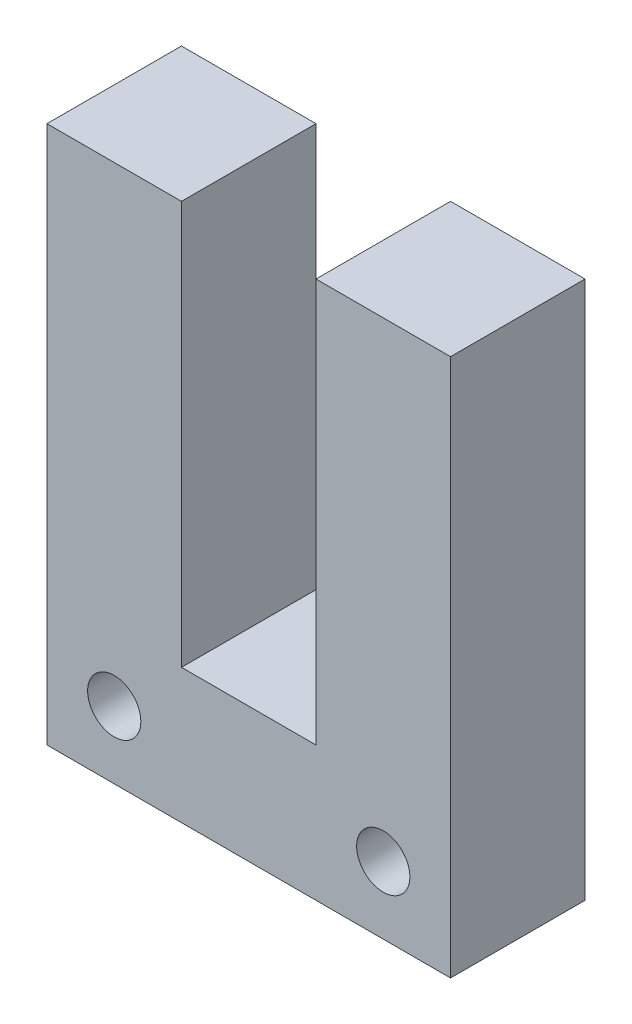
ISO-10303-21;
HEADER;
FILE_DESCRIPTION(('STEP AP214'),'2;1');
FILE_NAME('part.step','',(''),(''),'','','');
FILE_SCHEMA(('AUTOMOTIVE_DESIGN { 1 0 10303 214 1 1 1 1 }'));
ENDSEC;
DATA;
#1=APPLICATION_CONTEXT('core data for automotive mechanical design processes');
#2=APPLICATION_PROTOCOL_DEFINITION('international standard','automotive_design',2000,#1);
#3=PRODUCT_CONTEXT('',#1,'mechanical');
#4=PRODUCT('Part','Part','',(#3));
#5=PRODUCT_RELATED_PRODUCT_CATEGORY('part','',(#4));
#6=PRODUCT_DEFINITION_FORMATION('','',#4);
#7=PRODUCT_DEFINITION_CONTEXT('part definition',#1,'design');
#8=PRODUCT_DEFINITION('design','',#6,#7);
#9=PRODUCT_DEFINITION_SHAPE('','',#8);
#10=(LENGTH_UNIT() NAMED_UNIT(*) SI_UNIT(.MILLI.,.METRE.));
#11=(NAMED_UNIT(*) PLANE_ANGLE_UNIT() SI_UNIT($,.RADIAN.));
#12=(NAMED_UNIT(*) SI_UNIT($,.STERADIAN.) SOLID_ANGLE_UNIT());
#13=UNCERTAINTY_MEASURE_WITH_UNIT(LENGTH_MEASURE(1.E-05),#10,'distance_accuracy_value','');
#14=(GEOMETRIC_REPRESENTATION_CONTEXT(3) GLOBAL_UNCERTAINTY_ASSIGNED_CONTEXT((#13)) GLOBAL_UNIT_ASSIGNED_CONTEXT((#10,
#11,#12)) REPRESENTATION_CONTEXT('',''));
#15=CARTESIAN_POINT('',(0.,0.,0.));
#16=DIRECTION('',(0.,0.,1.));
#17=DIRECTION('',(1.,0.,0.));
#18=AXIS2_PLACEMENT_3D('',#15,#16,#17);
#19=CARTESIAN_POINT('',(0.,25.4,6.35));
#20=DIRECTION('',(0.,-1.,0.));
#21=DIRECTION('',(0.,0.,-1.));
#22=AXIS2_PLACEMENT_3D('',#19,#20,#21);
#23=PLANE('',#22);
#24=DIRECTION('',(-1.,0.,0.));
#25=VECTOR('',#24,1.);
#26=CARTESIAN_POINT('',(0.,25.4,6.35));
#27=LINE('',#26,#25);
#28=CARTESIAN_POINT('',(6.35,25.4,6.35));
#29=VERTEX_POINT('',#28);
#30=CARTESIAN_POINT('',(0.,25.4,6.35));
#31=VERTEX_POINT('',#30);
#32=EDGE_CURVE('E59',#29,#31,#27,.T.);
#33=ORIENTED_EDGE('',*,*,#32,.F.);
#34=DIRECTION('',(0.,0.,1.));
#35=VECTOR('',#34,1.);
#36=CARTESIAN_POINT('',(6.35,25.4,-6.35));
#37=LINE('',#36,#35);
#38=CARTESIAN_POINT('',(6.35,25.4,0.));
#39=VERTEX_POINT('',#38);
#40=EDGE_CURVE('E122',#39,#29,#37,.T.);
#41=ORIENTED_EDGE('',*,*,#40,.F.);
#42=DIRECTION('',(-1.,0.,0.));
#43=VECTOR('',#42,1.);
#44=CARTESIAN_POINT('',(0.,25.4,0.));
#45=LINE('',#44,#43);
#46=CARTESIAN_POINT('',(0.,25.4,0.));
#47=VERTEX_POINT('',#46);
#48=EDGE_CURVE('E81',#39,#47,#45,.T.);
#49=ORIENTED_EDGE('',*,*,#48,.T.);
#50=DIRECTION('',(0.,0.,-1.));
#51=VECTOR('',#50,1.);
#52=CARTESIAN_POINT('',(0.,25.4,6.35));
#53=LINE('',#52,#51);
#54=EDGE_CURVE('E144',#31,#47,#53,.T.);
#55=ORIENTED_EDGE('',*,*,#54,.F.);
#56=EDGE_LOOP('',(#33,#41,#49,#55));
#57=FACE_BOUND('',#56,.T.);
#58=ADVANCED_FACE('F33',(#57),#23,.F.);
#59=CARTESIAN_POINT('',(0.,0.,6.35));
#60=DIRECTION('',(1.,0.,0.));
#61=DIRECTION('',(0.,0.,-1.));
#62=AXIS2_PLACEMENT_3D('',#59,#60,#61);
#63=PLANE('',#62);
#64=DIRECTION('',(0.,-1.,0.));
#65=VECTOR('',#64,1.);
#66=CARTESIAN_POINT('',(0.,0.,0.));
#67=LINE('',#66,#65);
#68=CARTESIAN_POINT('',(0.,0.,0.));
#69=VERTEX_POINT('',#68);
#70=EDGE_CURVE('E131',#47,#69,#67,.T.);
#71=ORIENTED_EDGE('',*,*,#70,.T.);
#72=DIRECTION('',(0.,0.,-1.));
#73=VECTOR('',#72,1.);
#74=CARTESIAN_POINT('',(0.,0.,6.35));
#75=LINE('',#74,#73);
#76=CARTESIAN_POINT('',(0.,0.,6.35));
#77=VERTEX_POINT('',#76);
#78=EDGE_CURVE('E160',#77,#69,#75,.T.);
#79=ORIENTED_EDGE('',*,*,#78,.F.);
#80=DIRECTION('',(0.,-1.,0.));
#81=VECTOR('',#80,1.);
#82=CARTESIAN_POINT('',(0.,0.,6.35));
#83=LINE('',#82,#81);
#84=EDGE_CURVE('E136',#31,#77,#83,.T.);
#85=ORIENTED_EDGE('',*,*,#84,.F.);
#86=ORIENTED_EDGE('',*,*,#54,.T.);
#87=EDGE_LOOP('',(#71,#79,#85,#86));
#88=FACE_BOUND('',#87,.T.);
#89=ADVANCED_FACE('F35',(#88),#63,.F.);
#90=CARTESIAN_POINT('',(0.,0.,6.35));
#91=DIRECTION('',(0.,1.,0.));
#92=DIRECTION('',(0.,0.,1.));
#93=AXIS2_PLACEMENT_3D('',#90,#91,#92);
#94=PLANE('',#93);
#95=DIRECTION('',(1.,0.,0.));
#96=VECTOR('',#95,1.);
#97=CARTESIAN_POINT('',(0.,0.,0.));
#98=LINE('',#97,#96);
#99=CARTESIAN_POINT('',(19.05,0.,0.));
#100=VERTEX_POINT('',#99);
#101=EDGE_CURVE('E147',#69,#100,#98,.T.);
#102=ORIENTED_EDGE('',*,*,#101,.T.);
#103=DIRECTION('',(0.,0.,-1.));
#104=VECTOR('',#103,1.);
#105=CARTESIAN_POINT('',(19.05,0.,6.35));
#106=LINE('',#105,#104);
#107=CARTESIAN_POINT('',(19.05,0.,6.35));
#108=VERTEX_POINT('',#107);
#109=EDGE_CURVE('E157',#108,#100,#106,.T.);
#110=ORIENTED_EDGE('',*,*,#109,.F.);
#111=DIRECTION('',(1.,0.,0.));
#112=VECTOR('',#111,1.);
#113=CARTESIAN_POINT('',(0.,0.,6.35));
#114=LINE('',#113,#112);
#115=EDGE_CURVE('E89',#77,#108,#114,.T.);
#116=ORIENTED_EDGE('',*,*,#115,.F.);
#117=ORIENTED_EDGE('',*,*,#78,.T.);
#118=EDGE_LOOP('',(#102,#110,#116,#117));
#119=FACE_BOUND('',#118,.T.);
#120=ADVANCED_FACE('F199',(#119),#94,.F.);
#121=CARTESIAN_POINT('',(19.05,0.,6.35));
#122=DIRECTION('',(-1.,0.,0.));
#123=DIRECTION('',(0.,0.,1.));
#124=AXIS2_PLACEMENT_3D('',#121,#122,#123);
#125=PLANE('',#124);
#126=DIRECTION('',(0.,1.,0.));
#127=VECTOR('',#126,1.);
#128=CARTESIAN_POINT('',(19.05,0.,0.));
#129=LINE('',#128,#127);
#130=CARTESIAN_POINT('',(19.05,25.4,0.));
#131=VERTEX_POINT('',#130);
#132=EDGE_CURVE('E149',#100,#131,#129,.T.);
#133=ORIENTED_EDGE('',*,*,#132,.T.);
#134=DIRECTION('',(0.,0.,-1.));
#135=VECTOR('',#134,1.);
#136=CARTESIAN_POINT('',(19.05,25.4,6.35));
#137=LINE('',#136,#135);
#138=CARTESIAN_POINT('',(19.05,25.4,6.35));
#139=VERTEX_POINT('',#138);
#140=EDGE_CURVE('E154',#139,#131,#137,.T.);
#141=ORIENTED_EDGE('',*,*,#140,.F.);
#142=DIRECTION('',(0.,1.,0.));
#143=VECTOR('',#142,1.);
#144=CARTESIAN_POINT('',(19.05,0.,6.35));
#145=LINE('',#144,#143);
#146=EDGE_CURVE('E140',#108,#139,#145,.T.);
#147=ORIENTED_EDGE('',*,*,#146,.F.);
#148=ORIENTED_EDGE('',*,*,#109,.T.);
#149=EDGE_LOOP('',(#133,#141,#147,#148));
#150=FACE_BOUND('',#149,.T.);
#151=ADVANCED_FACE('F191',(#150),#125,.F.);
#152=CARTESIAN_POINT('',(12.7,25.4,0.));
#153=VERTEX_POINT('',#152);
#154=EDGE_CURVE('E138',#131,#153,#45,.T.);
#155=ORIENTED_EDGE('',*,*,#154,.T.);
#156=DIRECTION('',(0.,0.,1.));
#157=VECTOR('',#156,1.);
#158=CARTESIAN_POINT('',(12.7,25.4,-6.35));
#159=LINE('',#158,#157);
#160=CARTESIAN_POINT('',(12.7,25.4,6.35));
#161=VERTEX_POINT('',#160);
#162=EDGE_CURVE('E132',#153,#161,#159,.T.);
#163=ORIENTED_EDGE('',*,*,#162,.T.);
#164=EDGE_CURVE('E142',#139,#161,#27,.T.);
#165=ORIENTED_EDGE('',*,*,#164,.F.);
#166=ORIENTED_EDGE('',*,*,#140,.T.);
#167=EDGE_LOOP('',(#155,#163,#165,#166));
#168=FACE_BOUND('',#167,.T.);
#169=ADVANCED_FACE('F181',(#168),#23,.F.);
#170=CARTESIAN_POINT('',(0.,0.,6.35));
#171=DIRECTION('',(0.,0.,-1.));
#172=DIRECTION('',(-1.,0.,0.));
#173=AXIS2_PLACEMENT_3D('',#170,#171,#172);
#174=PLANE('',#173);
#175=CARTESIAN_POINT('',(3.175,3.175,6.35));
#176=DIRECTION('',(0.,0.,1.));
#177=DIRECTION('',(1.,0.,0.));
#178=AXIS2_PLACEMENT_3D('',#175,#176,#177);
#179=CIRCLE('',#178,1.25603);
#180=CARTESIAN_POINT('',(4.43103,3.175,6.35));
#181=VERTEX_POINT('',#180);
#182=EDGE_CURVE('E165',#181,#181,#179,.T.);
#183=ORIENTED_EDGE('',*,*,#182,.F.);
#184=EDGE_LOOP('',(#183));
#185=FACE_BOUND('',#184,.T.);
#186=CARTESIAN_POINT('',(15.875,3.175,6.35));
#187=DIRECTION('',(0.,0.,1.));
#188=DIRECTION('',(1.,0.,0.));
#189=AXIS2_PLACEMENT_3D('',#186,#187,#188);
#190=CIRCLE('',#189,1.25603);
#191=CARTESIAN_POINT('',(17.13103,3.175,6.35));
#192=VERTEX_POINT('',#191);
#193=EDGE_CURVE('E170',#192,#192,#190,.T.);
#194=ORIENTED_EDGE('',*,*,#193,.F.);
#195=EDGE_LOOP('',(#194));
#196=FACE_BOUND('',#195,.T.);
#197=DIRECTION('',(1.,0.,0.));
#198=VECTOR('',#197,1.);
#199=CARTESIAN_POINT('',(6.35,6.35,6.35));
#200=LINE('',#199,#198);
#201=CARTESIAN_POINT('',(6.35,6.35,6.35));
#202=VERTEX_POINT('',#201);
#203=CARTESIAN_POINT('',(12.7,6.35,6.35));
#204=VERTEX_POINT('',#203);
#205=EDGE_CURVE('E112',#202,#204,#200,.T.);
#206=ORIENTED_EDGE('',*,*,#205,.F.);
#207=DIRECTION('',(0.,-1.,0.));
#208=VECTOR('',#207,1.);
#209=CARTESIAN_POINT('',(6.35,6.35,6.35));
#210=LINE('',#209,#208);
#211=EDGE_CURVE('E120',#29,#202,#210,.T.);
#212=ORIENTED_EDGE('',*,*,#211,.F.);
#213=ORIENTED_EDGE('',*,*,#32,.T.);
#214=ORIENTED_EDGE('',*,*,#84,.T.);
#215=ORIENTED_EDGE('',*,*,#115,.T.);
#216=ORIENTED_EDGE('',*,*,#146,.T.);
#217=ORIENTED_EDGE('',*,*,#164,.T.);
#218=DIRECTION('',(0.,1.,0.));
#219=VECTOR('',#218,1.);
#220=CARTESIAN_POINT('',(12.7,6.35,6.35));
#221=LINE('',#220,#219);
#222=EDGE_CURVE('E118',#204,#161,#221,.T.);
#223=ORIENTED_EDGE('',*,*,#222,.F.);
#224=EDGE_LOOP('',(#206,#212,#213,#214,#215,#216,#217,#223));
#225=FACE_BOUND('',#224,.T.);
#226=ADVANCED_FACE('F124',(#185,#196,#225),#174,.F.);
#227=CARTESIAN_POINT('',(0.,0.,0.));
#228=DIRECTION('',(0.,0.,-1.));
#229=DIRECTION('',(-1.,0.,0.));
#230=AXIS2_PLACEMENT_3D('',#227,#228,#229);
#231=PLANE('',#230);
#232=CARTESIAN_POINT('',(3.175,3.175,0.));
#233=DIRECTION('',(0.,0.,-1.));
#234=DIRECTION('',(-1.,0.,0.));
#235=AXIS2_PLACEMENT_3D('',#232,#233,#234);
#236=CIRCLE('',#235,1.25603);
#237=CARTESIAN_POINT('',(1.91897,3.175,0.));
#238=VERTEX_POINT('',#237);
#239=EDGE_CURVE('E37',#238,#238,#236,.T.);
#240=ORIENTED_EDGE('',*,*,#239,.F.);
#241=EDGE_LOOP('',(#240));
#242=FACE_BOUND('',#241,.T.);
#243=CARTESIAN_POINT('',(15.875,3.175,0.));
#244=DIRECTION('',(0.,0.,-1.));
#245=DIRECTION('',(-1.,0.,0.));
#246=AXIS2_PLACEMENT_3D('',#243,#244,#245);
#247=CIRCLE('',#246,1.25603);
#248=CARTESIAN_POINT('',(14.61897,3.175,0.));
#249=VERTEX_POINT('',#248);
#250=EDGE_CURVE('E163',#249,#249,#247,.T.);
#251=ORIENTED_EDGE('',*,*,#250,.F.);
#252=EDGE_LOOP('',(#251));
#253=FACE_BOUND('',#252,.T.);
#254=DIRECTION('',(0.,1.,0.));
#255=VECTOR('',#254,1.);
#256=CARTESIAN_POINT('',(6.35,0.,0.));
#257=LINE('',#256,#255);
#258=CARTESIAN_POINT('',(6.35,6.35,0.));
#259=VERTEX_POINT('',#258);
#260=EDGE_CURVE('E11',#259,#39,#257,.T.);
#261=ORIENTED_EDGE('',*,*,#260,.F.);
#262=DIRECTION('',(-1.,0.,0.));
#263=VECTOR('',#262,1.);
#264=CARTESIAN_POINT('',(0.,6.35,0.));
#265=LINE('',#264,#263);
#266=CARTESIAN_POINT('',(12.7,6.35,0.));
#267=VERTEX_POINT('',#266);
#268=EDGE_CURVE('E115',#267,#259,#265,.T.);
#269=ORIENTED_EDGE('',*,*,#268,.F.);
#270=DIRECTION('',(0.,-1.,0.));
#271=VECTOR('',#270,1.);
#272=CARTESIAN_POINT('',(12.7,0.,0.));
#273=LINE('',#272,#271);
#274=EDGE_CURVE('E42',#153,#267,#273,.T.);
#275=ORIENTED_EDGE('',*,*,#274,.F.);
#276=ORIENTED_EDGE('',*,*,#154,.F.);
#277=ORIENTED_EDGE('',*,*,#132,.F.);
#278=ORIENTED_EDGE('',*,*,#101,.F.);
#279=ORIENTED_EDGE('',*,*,#70,.F.);
#280=ORIENTED_EDGE('',*,*,#48,.F.);
#281=EDGE_LOOP('',(#261,#269,#275,#276,#277,#278,#279,#280));
#282=FACE_BOUND('',#281,.T.);
#283=ADVANCED_FACE('F180',(#242,#253,#282),#231,.T.);
#284=CARTESIAN_POINT('',(6.35,6.35,-6.35));
#285=DIRECTION('',(-1.,0.,0.));
#286=DIRECTION('',(0.,0.,1.));
#287=AXIS2_PLACEMENT_3D('',#284,#285,#286);
#288=PLANE('',#287);
#289=ORIENTED_EDGE('',*,*,#260,.T.);
#290=ORIENTED_EDGE('',*,*,#40,.T.);
#291=ORIENTED_EDGE('',*,*,#211,.T.);
#292=DIRECTION('',(0.,0.,1.));
#293=VECTOR('',#292,1.);
#294=CARTESIAN_POINT('',(6.35,6.35,-6.35));
#295=LINE('',#294,#293);
#296=EDGE_CURVE('E108',#259,#202,#295,.T.);
#297=ORIENTED_EDGE('',*,*,#296,.F.);
#298=EDGE_LOOP('',(#289,#290,#291,#297));
#299=FACE_BOUND('',#298,.T.);
#300=ADVANCED_FACE('F121',(#299),#288,.F.);
#301=CARTESIAN_POINT('',(12.7,6.35,-6.35));
#302=DIRECTION('',(1.,0.,0.));
#303=DIRECTION('',(0.,0.,-1.));
#304=AXIS2_PLACEMENT_3D('',#301,#302,#303);
#305=PLANE('',#304);
#306=ORIENTED_EDGE('',*,*,#274,.T.);
#307=DIRECTION('',(0.,0.,1.));
#308=VECTOR('',#307,1.);
#309=CARTESIAN_POINT('',(12.7,6.35,-6.35));
#310=LINE('',#309,#308);
#311=EDGE_CURVE('E50',#267,#204,#310,.T.);
#312=ORIENTED_EDGE('',*,*,#311,.T.);
#313=ORIENTED_EDGE('',*,*,#222,.T.);
#314=ORIENTED_EDGE('',*,*,#162,.F.);
#315=EDGE_LOOP('',(#306,#312,#313,#314));
#316=FACE_BOUND('',#315,.T.);
#317=ADVANCED_FACE('F218',(#316),#305,.F.);
#318=CARTESIAN_POINT('',(6.35,6.35,-6.35));
#319=DIRECTION('',(0.,-1.,0.));
#320=DIRECTION('',(0.,0.,-1.));
#321=AXIS2_PLACEMENT_3D('',#318,#319,#320);
#322=PLANE('',#321);
#323=ORIENTED_EDGE('',*,*,#268,.T.);
#324=ORIENTED_EDGE('',*,*,#296,.T.);
#325=ORIENTED_EDGE('',*,*,#205,.T.);
#326=ORIENTED_EDGE('',*,*,#311,.F.);
#327=EDGE_LOOP('',(#323,#324,#325,#326));
#328=FACE_BOUND('',#327,.T.);
#329=ADVANCED_FACE('F110',(#328),#322,.F.);
#330=CARTESIAN_POINT('',(15.875,3.175,-6.35));
#331=DIRECTION('',(0.,0.,1.));
#332=DIRECTION('',(1.,0.,0.));
#333=AXIS2_PLACEMENT_3D('',#330,#331,#332);
#334=CYLINDRICAL_SURFACE('',#333,1.25603);
#335=ORIENTED_EDGE('',*,*,#250,.T.);
#336=EDGE_LOOP('',(#335));
#337=FACE_BOUND('',#336,.T.);
#338=ORIENTED_EDGE('',*,*,#193,.T.);
#339=EDGE_LOOP('',(#338));
#340=FACE_BOUND('',#339,.T.);
#341=ADVANCED_FACE('F177',(#337,#340),#334,.F.);
#342=CARTESIAN_POINT('',(3.175,3.175,-6.35));
#343=DIRECTION('',(0.,0.,1.));
#344=DIRECTION('',(1.,0.,0.));
#345=AXIS2_PLACEMENT_3D('',#342,#343,#344);
#346=CYLINDRICAL_SURFACE('',#345,1.25603);
#347=ORIENTED_EDGE('',*,*,#239,.T.);
#348=EDGE_LOOP('',(#347));
#349=FACE_BOUND('',#348,.T.);
#350=ORIENTED_EDGE('',*,*,#182,.T.);
#351=EDGE_LOOP('',(#350));
#352=FACE_BOUND('',#351,.T.);
#353=ADVANCED_FACE('F229',(#349,#352),#346,.F.);
#354=CLOSED_SHELL('',(#58,#89,#120,#151,#169,#226,#283,#300,#317,#329,#341,#353));
#355=MANIFOLD_SOLID_BREP('B2',#354);
#356=ADVANCED_BREP_SHAPE_REPRESENTATION('',(#18,#355),#14);
#357=SHAPE_DEFINITION_REPRESENTATION(#9,#356);
ENDSEC;
END-ISO-10303-21;
